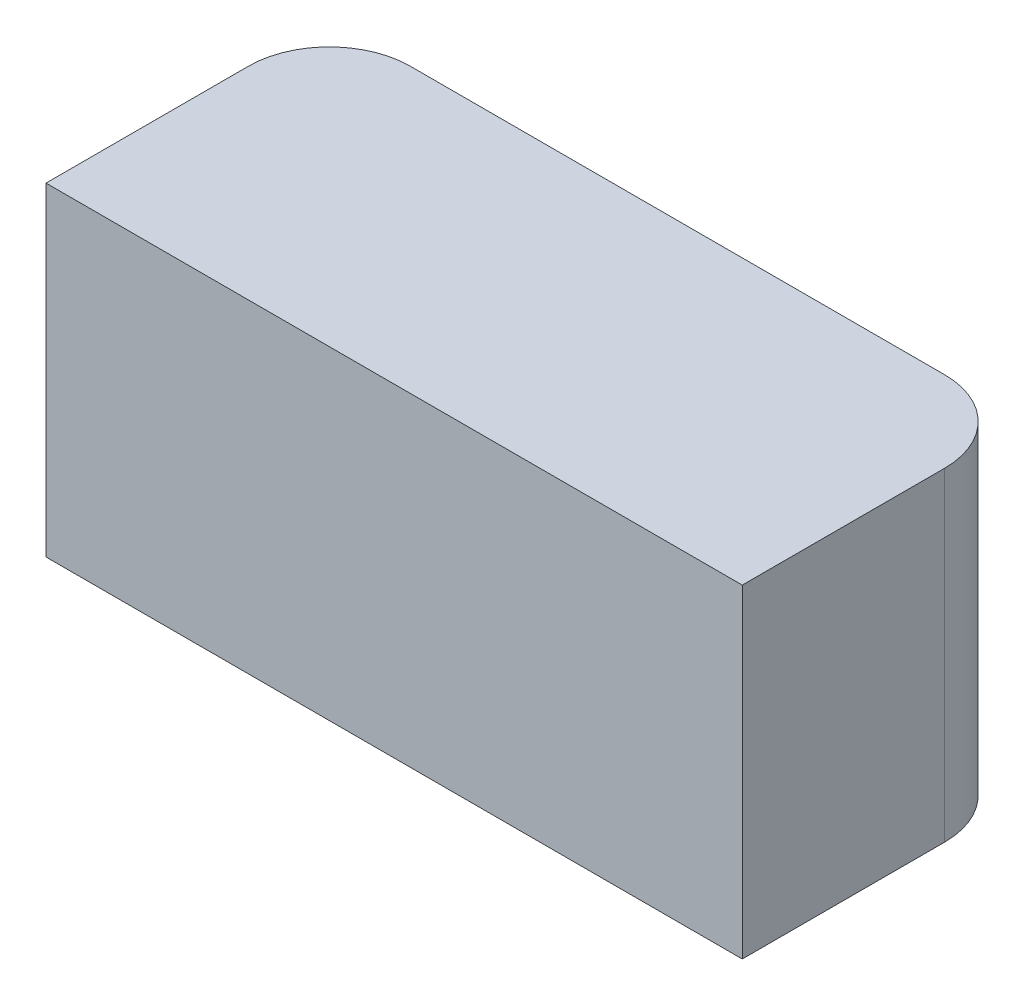
ISO-10303-21;
HEADER;
FILE_DESCRIPTION(('STEP AP214'),'2;1');
FILE_NAME('part.step','',(''),(''),'','','');
FILE_SCHEMA(('AUTOMOTIVE_DESIGN { 1 0 10303 214 1 1 1 1 }'));
ENDSEC;
DATA;
#1=APPLICATION_CONTEXT('core data for automotive mechanical design processes');
#2=APPLICATION_PROTOCOL_DEFINITION('international standard','automotive_design',2000,#1);
#3=PRODUCT_CONTEXT('',#1,'mechanical');
#4=PRODUCT('Part','Part','',(#3));
#5=PRODUCT_RELATED_PRODUCT_CATEGORY('part','',(#4));
#6=PRODUCT_DEFINITION_FORMATION('','',#4);
#7=PRODUCT_DEFINITION_CONTEXT('part definition',#1,'design');
#8=PRODUCT_DEFINITION('design','',#6,#7);
#9=PRODUCT_DEFINITION_SHAPE('','',#8);
#10=(LENGTH_UNIT() NAMED_UNIT(*) SI_UNIT(.MILLI.,.METRE.));
#11=(NAMED_UNIT(*) PLANE_ANGLE_UNIT() SI_UNIT($,.RADIAN.));
#12=(NAMED_UNIT(*) SI_UNIT($,.STERADIAN.) SOLID_ANGLE_UNIT());
#13=UNCERTAINTY_MEASURE_WITH_UNIT(LENGTH_MEASURE(1.E-05),#10,'distance_accuracy_value','');
#14=(GEOMETRIC_REPRESENTATION_CONTEXT(3) GLOBAL_UNCERTAINTY_ASSIGNED_CONTEXT((#13)) GLOBAL_UNIT_ASSIGNED_CONTEXT((#10,
#11,#12)) REPRESENTATION_CONTEXT('',''));
#15=CARTESIAN_POINT('',(0.,0.,0.));
#16=DIRECTION('',(0.,0.,1.));
#17=DIRECTION('',(1.,0.,0.));
#18=AXIS2_PLACEMENT_3D('',#15,#16,#17);
#19=CARTESIAN_POINT('',(2.28,0.,2.875));
#20=DIRECTION('',(0.,1.,0.));
#21=DIRECTION('',(0.,0.,1.));
#22=AXIS2_PLACEMENT_3D('',#19,#20,#21);
#23=CYLINDRICAL_SURFACE('',#22,0.05);
#24=DIRECTION('',(0.,1.,0.));
#25=VECTOR('',#24,1.);
#26=CARTESIAN_POINT('',(2.33,0.,2.875));
#27=LINE('',#26,#25);
#28=CARTESIAN_POINT('',(2.33,0.,2.875));
#29=VERTEX_POINT('',#28);
#30=CARTESIAN_POINT('',(2.33,0.2,2.875));
#31=VERTEX_POINT('',#30);
#32=EDGE_CURVE('E67',#29,#31,#27,.T.);
#33=ORIENTED_EDGE('',*,*,#32,.F.);
#34=CARTESIAN_POINT('',(2.28,0.,2.875));
#35=DIRECTION('',(0.,1.,0.));
#36=DIRECTION('',(0.,0.,1.));
#37=AXIS2_PLACEMENT_3D('',#34,#35,#36);
#38=CIRCLE('',#37,0.05);
#39=CARTESIAN_POINT('',(2.28,0.,2.825));
#40=VERTEX_POINT('',#39);
#41=EDGE_CURVE('E77',#29,#40,#38,.T.);
#42=ORIENTED_EDGE('',*,*,#41,.T.);
#43=DIRECTION('',(0.,1.,0.));
#44=VECTOR('',#43,1.);
#45=CARTESIAN_POINT('',(2.28,0.,2.825));
#46=LINE('',#45,#44);
#47=CARTESIAN_POINT('',(2.28,0.2,2.825));
#48=VERTEX_POINT('',#47);
#49=EDGE_CURVE('E72',#48,#40,#46,.F.);
#50=ORIENTED_EDGE('',*,*,#49,.F.);
#51=CARTESIAN_POINT('',(2.28,0.2,2.875));
#52=DIRECTION('',(0.,1.,0.));
#53=DIRECTION('',(0.,0.,1.));
#54=AXIS2_PLACEMENT_3D('',#51,#52,#53);
#55=CIRCLE('',#54,0.05);
#56=EDGE_CURVE('E20',#31,#48,#55,.T.);
#57=ORIENTED_EDGE('',*,*,#56,.F.);
#58=EDGE_LOOP('',(#33,#42,#50,#57));
#59=FACE_BOUND('',#58,.T.);
#60=ADVANCED_FACE('F17',(#59),#23,.T.);
#61=CARTESIAN_POINT('',(2.28,0.,2.825));
#62=DIRECTION('',(0.,0.,-1.));
#63=DIRECTION('',(-1.,0.,0.));
#64=AXIS2_PLACEMENT_3D('',#61,#62,#63);
#65=PLANE('',#64);
#66=ORIENTED_EDGE('',*,*,#49,.T.);
#67=DIRECTION('',(1.,0.,0.));
#68=VECTOR('',#67,1.);
#69=CARTESIAN_POINT('',(0.,0.,2.825));
#70=LINE('',#69,#68);
#71=CARTESIAN_POINT('',(1.95,0.,2.825));
#72=VERTEX_POINT('',#71);
#73=EDGE_CURVE('E126',#40,#72,#70,.F.);
#74=ORIENTED_EDGE('',*,*,#73,.T.);
#75=DIRECTION('',(0.,1.,0.));
#76=VECTOR('',#75,1.);
#77=CARTESIAN_POINT('',(1.95,0.,2.825));
#78=LINE('',#77,#76);
#79=CARTESIAN_POINT('',(1.95,0.2,2.825));
#80=VERTEX_POINT('',#79);
#81=EDGE_CURVE('E80',#80,#72,#78,.F.);
#82=ORIENTED_EDGE('',*,*,#81,.F.);
#83=DIRECTION('',(1.,0.,0.));
#84=VECTOR('',#83,1.);
#85=CARTESIAN_POINT('',(0.,0.2,2.825));
#86=LINE('',#85,#84);
#87=EDGE_CURVE('E83',#48,#80,#86,.F.);
#88=ORIENTED_EDGE('',*,*,#87,.F.);
#89=EDGE_LOOP('',(#66,#74,#82,#88));
#90=FACE_BOUND('',#89,.T.);
#91=ADVANCED_FACE('F84',(#90),#65,.T.);
#92=CARTESIAN_POINT('',(1.95,0.,2.875));
#93=DIRECTION('',(0.,1.,0.));
#94=DIRECTION('',(0.,0.,1.));
#95=AXIS2_PLACEMENT_3D('',#92,#93,#94);
#96=CYLINDRICAL_SURFACE('',#95,0.05);
#97=ORIENTED_EDGE('',*,*,#81,.T.);
#98=CARTESIAN_POINT('',(1.95,0.,2.875));
#99=DIRECTION('',(0.,1.,0.));
#100=DIRECTION('',(0.,0.,1.));
#101=AXIS2_PLACEMENT_3D('',#98,#99,#100);
#102=CIRCLE('',#101,0.05);
#103=CARTESIAN_POINT('',(1.9,0.,2.875));
#104=VERTEX_POINT('',#103);
#105=EDGE_CURVE('E124',#72,#104,#102,.T.);
#106=ORIENTED_EDGE('',*,*,#105,.T.);
#107=DIRECTION('',(0.,1.,0.));
#108=VECTOR('',#107,1.);
#109=CARTESIAN_POINT('',(1.9,0.,2.875));
#110=LINE('',#109,#108);
#111=CARTESIAN_POINT('',(1.9,0.2,2.875));
#112=VERTEX_POINT('',#111);
#113=EDGE_CURVE('E99',#112,#104,#110,.F.);
#114=ORIENTED_EDGE('',*,*,#113,.F.);
#115=CARTESIAN_POINT('',(1.95,0.2,2.875));
#116=DIRECTION('',(0.,1.,0.));
#117=DIRECTION('',(0.,0.,1.));
#118=AXIS2_PLACEMENT_3D('',#115,#116,#117);
#119=CIRCLE('',#118,0.05);
#120=EDGE_CURVE('E88',#80,#112,#119,.T.);
#121=ORIENTED_EDGE('',*,*,#120,.F.);
#122=EDGE_LOOP('',(#97,#106,#114,#121));
#123=FACE_BOUND('',#122,.T.);
#124=ADVANCED_FACE('F129',(#123),#96,.T.);
#125=CARTESIAN_POINT('',(2.33,0.,3.));
#126=DIRECTION('',(1.,0.,0.));
#127=DIRECTION('',(0.,0.,-1.));
#128=AXIS2_PLACEMENT_3D('',#125,#126,#127);
#129=PLANE('',#128);
#130=DIRECTION('',(0.,1.,0.));
#131=VECTOR('',#130,1.);
#132=CARTESIAN_POINT('',(2.33,0.,3.));
#133=LINE('',#132,#131);
#134=CARTESIAN_POINT('',(2.33,0.,3.));
#135=VERTEX_POINT('',#134);
#136=CARTESIAN_POINT('',(2.33,0.2,3.));
#137=VERTEX_POINT('',#136);
#138=EDGE_CURVE('E111',#135,#137,#133,.T.);
#139=ORIENTED_EDGE('',*,*,#138,.F.);
#140=DIRECTION('',(0.,0.,1.));
#141=VECTOR('',#140,1.);
#142=CARTESIAN_POINT('',(2.33,0.,0.));
#143=LINE('',#142,#141);
#144=EDGE_CURVE('E100',#135,#29,#143,.F.);
#145=ORIENTED_EDGE('',*,*,#144,.T.);
#146=ORIENTED_EDGE('',*,*,#32,.T.);
#147=DIRECTION('',(0.,0.,1.));
#148=VECTOR('',#147,1.);
#149=CARTESIAN_POINT('',(2.33,0.2,0.));
#150=LINE('',#149,#148);
#151=EDGE_CURVE('E92',#137,#31,#150,.F.);
#152=ORIENTED_EDGE('',*,*,#151,.F.);
#153=EDGE_LOOP('',(#139,#145,#146,#152));
#154=FACE_BOUND('',#153,.T.);
#155=ADVANCED_FACE('F135',(#154),#129,.T.);
#156=CARTESIAN_POINT('',(0.,0.2,0.));
#157=DIRECTION('',(0.,1.,0.));
#158=DIRECTION('',(0.,0.,1.));
#159=AXIS2_PLACEMENT_3D('',#156,#157,#158);
#160=PLANE('',#159);
#161=DIRECTION('',(0.,0.,1.));
#162=VECTOR('',#161,1.);
#163=CARTESIAN_POINT('',(1.9,0.2,2.875));
#164=LINE('',#163,#162);
#165=CARTESIAN_POINT('',(1.9,0.2,3.));
#166=VERTEX_POINT('',#165);
#167=EDGE_CURVE('E101',#166,#112,#164,.F.);
#168=ORIENTED_EDGE('',*,*,#167,.F.);
#169=DIRECTION('',(1.,0.,0.));
#170=VECTOR('',#169,1.);
#171=CARTESIAN_POINT('',(1.9,0.2,3.));
#172=LINE('',#171,#170);
#173=EDGE_CURVE('E107',#137,#166,#172,.F.);
#174=ORIENTED_EDGE('',*,*,#173,.F.);
#175=ORIENTED_EDGE('',*,*,#151,.T.);
#176=ORIENTED_EDGE('',*,*,#56,.T.);
#177=ORIENTED_EDGE('',*,*,#87,.T.);
#178=ORIENTED_EDGE('',*,*,#120,.T.);
#179=EDGE_LOOP('',(#168,#174,#175,#176,#177,#178));
#180=FACE_BOUND('',#179,.T.);
#181=ADVANCED_FACE('F90',(#180),#160,.T.);
#182=CARTESIAN_POINT('',(1.9,0.,2.875));
#183=DIRECTION('',(-1.,0.,0.));
#184=DIRECTION('',(0.,0.,1.));
#185=AXIS2_PLACEMENT_3D('',#182,#183,#184);
#186=PLANE('',#185);
#187=ORIENTED_EDGE('',*,*,#113,.T.);
#188=DIRECTION('',(0.,0.,1.));
#189=VECTOR('',#188,1.);
#190=CARTESIAN_POINT('',(1.9,0.,0.));
#191=LINE('',#190,#189);
#192=CARTESIAN_POINT('',(1.9,0.,3.));
#193=VERTEX_POINT('',#192);
#194=EDGE_CURVE('E35',#104,#193,#191,.T.);
#195=ORIENTED_EDGE('',*,*,#194,.T.);
#196=DIRECTION('',(0.,1.,0.));
#197=VECTOR('',#196,1.);
#198=CARTESIAN_POINT('',(1.9,0.,3.));
#199=LINE('',#198,#197);
#200=EDGE_CURVE('E26',#166,#193,#199,.F.);
#201=ORIENTED_EDGE('',*,*,#200,.F.);
#202=ORIENTED_EDGE('',*,*,#167,.T.);
#203=EDGE_LOOP('',(#187,#195,#201,#202));
#204=FACE_BOUND('',#203,.T.);
#205=ADVANCED_FACE('F131',(#204),#186,.T.);
#206=CARTESIAN_POINT('',(0.,0.,0.));
#207=DIRECTION('',(0.,1.,0.));
#208=DIRECTION('',(0.,0.,1.));
#209=AXIS2_PLACEMENT_3D('',#206,#207,#208);
#210=PLANE('',#209);
#211=ORIENTED_EDGE('',*,*,#105,.F.);
#212=ORIENTED_EDGE('',*,*,#73,.F.);
#213=ORIENTED_EDGE('',*,*,#41,.F.);
#214=ORIENTED_EDGE('',*,*,#144,.F.);
#215=DIRECTION('',(1.,0.,0.));
#216=VECTOR('',#215,1.);
#217=CARTESIAN_POINT('',(1.9,0.,3.));
#218=LINE('',#217,#216);
#219=EDGE_CURVE('E11',#193,#135,#218,.T.);
#220=ORIENTED_EDGE('',*,*,#219,.F.);
#221=ORIENTED_EDGE('',*,*,#194,.F.);
#222=EDGE_LOOP('',(#211,#212,#213,#214,#220,#221));
#223=FACE_BOUND('',#222,.T.);
#224=ADVANCED_FACE('F137',(#223),#210,.F.);
#225=CARTESIAN_POINT('',(1.9,0.,3.));
#226=DIRECTION('',(0.,0.,1.));
#227=DIRECTION('',(1.,0.,0.));
#228=AXIS2_PLACEMENT_3D('',#225,#226,#227);
#229=PLANE('',#228);
#230=ORIENTED_EDGE('',*,*,#200,.T.);
#231=ORIENTED_EDGE('',*,*,#219,.T.);
#232=ORIENTED_EDGE('',*,*,#138,.T.);
#233=ORIENTED_EDGE('',*,*,#173,.T.);
#234=EDGE_LOOP('',(#230,#231,#232,#233));
#235=FACE_BOUND('',#234,.T.);
#236=ADVANCED_FACE('F133',(#235),#229,.T.);
#237=CLOSED_SHELL('',(#60,#91,#124,#155,#181,#205,#224,#236));
#238=MANIFOLD_SOLID_BREP('B1',#237);
#239=ADVANCED_BREP_SHAPE_REPRESENTATION('',(#18,#238),#14);
#240=SHAPE_DEFINITION_REPRESENTATION(#9,#239);
ENDSEC;
END-ISO-10303-21;
